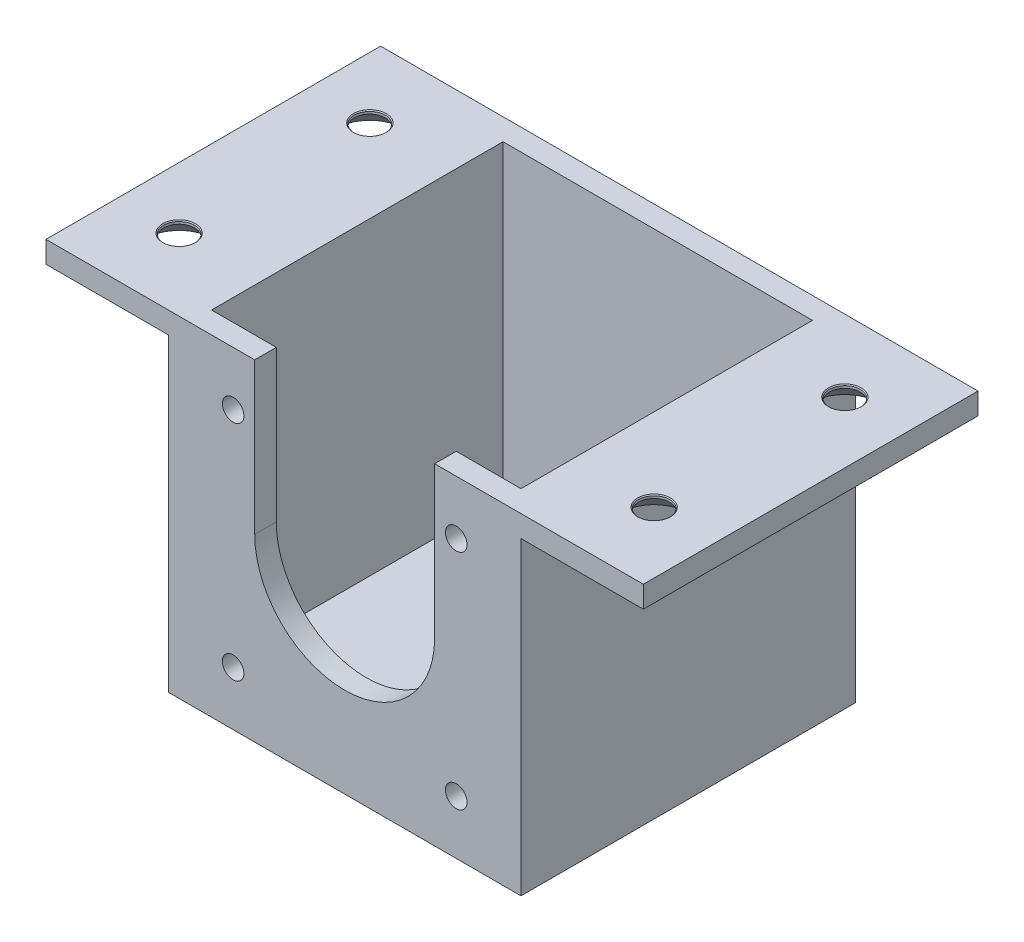
ISO-10303-21;
HEADER;
FILE_DESCRIPTION(('STEP AP214'),'2;1');
FILE_NAME('part.step','',(''),(''),'','','');
FILE_SCHEMA(('AUTOMOTIVE_DESIGN { 1 0 10303 214 1 1 1 1 }'));
ENDSEC;
DATA;
#1=APPLICATION_CONTEXT('core data for automotive mechanical design processes');
#2=APPLICATION_PROTOCOL_DEFINITION('international standard','automotive_design',2000,#1);
#3=PRODUCT_CONTEXT('',#1,'mechanical');
#4=PRODUCT('Part','Part','',(#3));
#5=PRODUCT_RELATED_PRODUCT_CATEGORY('part','',(#4));
#6=PRODUCT_DEFINITION_FORMATION('','',#4);
#7=PRODUCT_DEFINITION_CONTEXT('part definition',#1,'design');
#8=PRODUCT_DEFINITION('design','',#6,#7);
#9=PRODUCT_DEFINITION_SHAPE('','',#8);
#10=(LENGTH_UNIT() NAMED_UNIT(*) SI_UNIT(.MILLI.,.METRE.));
#11=(NAMED_UNIT(*) PLANE_ANGLE_UNIT() SI_UNIT($,.RADIAN.));
#12=(NAMED_UNIT(*) SI_UNIT($,.STERADIAN.) SOLID_ANGLE_UNIT());
#13=UNCERTAINTY_MEASURE_WITH_UNIT(LENGTH_MEASURE(1.E-05),#10,'distance_accuracy_value','');
#14=(GEOMETRIC_REPRESENTATION_CONTEXT(3) GLOBAL_UNCERTAINTY_ASSIGNED_CONTEXT((#13)) GLOBAL_UNIT_ASSIGNED_CONTEXT((#10,
#11,#12)) REPRESENTATION_CONTEXT('',''));
#15=CARTESIAN_POINT('',(0.,0.,0.));
#16=DIRECTION('',(0.,0.,1.));
#17=DIRECTION('',(1.,0.,0.));
#18=AXIS2_PLACEMENT_3D('',#15,#16,#17);
#19=CARTESIAN_POINT('',(-43.,40.,46.5));
#20=DIRECTION('',(0.,1.,0.));
#21=DIRECTION('',(0.,0.,1.));
#22=AXIS2_PLACEMENT_3D('',#19,#20,#21);
#23=PLANE('',#22);
#24=CARTESIAN_POINT('',(-54.5,40.,10.));
#25=DIRECTION('',(0.,-1.,0.));
#26=DIRECTION('',(0.,0.,-1.));
#27=AXIS2_PLACEMENT_3D('',#24,#25,#26);
#28=CIRCLE('',#27,4.7);
#29=CARTESIAN_POINT('',(-54.5,40.,5.3));
#30=VERTEX_POINT('',#29);
#31=EDGE_CURVE('E240',#30,#30,#28,.T.);
#32=ORIENTED_EDGE('',*,*,#31,.F.);
#33=EDGE_LOOP('',(#32));
#34=FACE_BOUND('',#33,.T.);
#35=DIRECTION('',(1.,0.,0.));
#36=VECTOR('',#35,1.);
#37=CARTESIAN_POINT('',(-43.,40.,0.));
#38=LINE('',#37,#36);
#39=CARTESIAN_POINT('',(-63.,40.,0.));
#40=VERTEX_POINT('',#39);
#41=CARTESIAN_POINT('',(-46.,40.,0.));
#42=VERTEX_POINT('',#41);
#43=EDGE_CURVE('E367',#40,#42,#38,.T.);
#44=ORIENTED_EDGE('',*,*,#43,.T.);
#45=DIRECTION('',(0.,0.,-1.));
#46=VECTOR('',#45,1.);
#47=CARTESIAN_POINT('',(-46.,40.,46.5));
#48=LINE('',#47,#46);
#49=CARTESIAN_POINT('',(-46.,40.,46.5));
#50=VERTEX_POINT('',#49);
#51=EDGE_CURVE('E383',#50,#42,#48,.T.);
#52=ORIENTED_EDGE('',*,*,#51,.F.);
#53=DIRECTION('',(1.,0.,0.));
#54=VECTOR('',#53,1.);
#55=CARTESIAN_POINT('',(-43.,40.,46.5));
#56=LINE('',#55,#54);
#57=CARTESIAN_POINT('',(-63.,40.,46.5));
#58=VERTEX_POINT('',#57);
#59=EDGE_CURVE('E348',#58,#50,#56,.T.);
#60=ORIENTED_EDGE('',*,*,#59,.F.);
#61=DIRECTION('',(0.,0.,-1.));
#62=VECTOR('',#61,1.);
#63=CARTESIAN_POINT('',(-63.,40.,46.5));
#64=LINE('',#63,#62);
#65=EDGE_CURVE('E386',#58,#40,#64,.T.);
#66=ORIENTED_EDGE('',*,*,#65,.T.);
#67=EDGE_LOOP('',(#44,#52,#60,#66));
#68=FACE_BOUND('',#67,.T.);
#69=CARTESIAN_POINT('',(-54.5,40.,36.5));
#70=DIRECTION('',(0.,-1.,0.));
#71=DIRECTION('',(0.,0.,-1.));
#72=AXIS2_PLACEMENT_3D('',#69,#70,#71);
#73=CIRCLE('',#72,4.7);
#74=CARTESIAN_POINT('',(-54.5,40.,31.8));
#75=VERTEX_POINT('',#74);
#76=EDGE_CURVE('E252',#75,#75,#73,.T.);
#77=ORIENTED_EDGE('',*,*,#76,.F.);
#78=EDGE_LOOP('',(#77));
#79=FACE_BOUND('',#78,.T.);
#80=ADVANCED_FACE('F32',(#34,#68,#79),#23,.F.);
#81=CARTESIAN_POINT('',(0.,0.,46.5));
#82=DIRECTION('',(-1.,0.,0.));
#83=DIRECTION('',(0.,0.,1.));
#84=AXIS2_PLACEMENT_3D('',#81,#82,#83);
#85=PLANE('',#84);
#86=DIRECTION('',(0.,0.,-1.));
#87=VECTOR('',#86,1.);
#88=CARTESIAN_POINT('',(0.,0.,46.5));
#89=LINE('',#88,#87);
#90=CARTESIAN_POINT('',(0.,0.,43.5));
#91=VERTEX_POINT('',#90);
#92=CARTESIAN_POINT('',(0.,0.,3.));
#93=VERTEX_POINT('',#92);
#94=EDGE_CURVE('E394',#91,#93,#89,.T.);
#95=ORIENTED_EDGE('',*,*,#94,.F.);
#96=DIRECTION('',(0.,-1.,0.));
#97=VECTOR('',#96,1.);
#98=CARTESIAN_POINT('',(0.,43.,43.5));
#99=LINE('',#98,#97);
#100=CARTESIAN_POINT('',(0.,43.,43.5));
#101=VERTEX_POINT('',#100);
#102=EDGE_CURVE('E313',#101,#91,#99,.T.);
#103=ORIENTED_EDGE('',*,*,#102,.F.);
#104=DIRECTION('',(0.,0.,-1.));
#105=VECTOR('',#104,1.);
#106=CARTESIAN_POINT('',(0.,43.,46.5));
#107=LINE('',#106,#105);
#108=CARTESIAN_POINT('',(0.,43.,3.));
#109=VERTEX_POINT('',#108);
#110=EDGE_CURVE('E397',#101,#109,#107,.T.);
#111=ORIENTED_EDGE('',*,*,#110,.T.);
#112=DIRECTION('',(0.,-1.,0.));
#113=VECTOR('',#112,1.);
#114=CARTESIAN_POINT('',(0.,43.,3.));
#115=LINE('',#114,#113);
#116=EDGE_CURVE('E325',#109,#93,#115,.T.);
#117=ORIENTED_EDGE('',*,*,#116,.T.);
#118=EDGE_LOOP('',(#95,#103,#111,#117));
#119=FACE_BOUND('',#118,.T.);
#120=ADVANCED_FACE('F468',(#119),#85,.T.);
#121=CARTESIAN_POINT('',(0.,0.,46.5));
#122=DIRECTION('',(0.,1.,0.));
#123=DIRECTION('',(-1.,0.,0.));
#124=AXIS2_PLACEMENT_3D('',#121,#122,#123);
#125=PLANE('',#124);
#126=DIRECTION('',(0.,0.,-1.));
#127=VECTOR('',#126,1.);
#128=CARTESIAN_POINT('',(-8.99999999999999,0.,46.5));
#129=LINE('',#128,#127);
#130=CARTESIAN_POINT('',(-8.99999999999999,0.,15.));
#131=VERTEX_POINT('',#130);
#132=CARTESIAN_POINT('',(-9.,0.,3.));
#133=VERTEX_POINT('',#132);
#134=EDGE_CURVE('E201',#131,#133,#129,.T.);
#135=ORIENTED_EDGE('',*,*,#134,.F.);
#136=DIRECTION('',(1.,0.,0.));
#137=VECTOR('',#136,1.);
#138=CARTESIAN_POINT('',(0.,0.,15.));
#139=LINE('',#138,#137);
#140=CARTESIAN_POINT('',(-34.,0.,15.));
#141=VERTEX_POINT('',#140);
#142=EDGE_CURVE('E211',#141,#131,#139,.T.);
#143=ORIENTED_EDGE('',*,*,#142,.F.);
#144=DIRECTION('',(0.,0.,1.));
#145=VECTOR('',#144,1.);
#146=CARTESIAN_POINT('',(-34.,0.,46.5));
#147=LINE('',#146,#145);
#148=CARTESIAN_POINT('',(-34.,0.,3.));
#149=VERTEX_POINT('',#148);
#150=EDGE_CURVE('E199',#149,#141,#147,.T.);
#151=ORIENTED_EDGE('',*,*,#150,.F.);
#152=DIRECTION('',(1.,0.,0.));
#153=VECTOR('',#152,1.);
#154=CARTESIAN_POINT('',(-43.,0.,3.));
#155=LINE('',#154,#153);
#156=CARTESIAN_POINT('',(-43.,0.,3.));
#157=VERTEX_POINT('',#156);
#158=EDGE_CURVE('E326',#157,#149,#155,.T.);
#159=ORIENTED_EDGE('',*,*,#158,.F.);
#160=DIRECTION('',(0.,0.,-1.));
#161=VECTOR('',#160,1.);
#162=CARTESIAN_POINT('',(-43.,0.,46.5));
#163=LINE('',#162,#161);
#164=CARTESIAN_POINT('',(-43.,0.,43.5));
#165=VERTEX_POINT('',#164);
#166=EDGE_CURVE('E392',#165,#157,#163,.T.);
#167=ORIENTED_EDGE('',*,*,#166,.F.);
#168=DIRECTION('',(-1.,0.,0.));
#169=VECTOR('',#168,1.);
#170=CARTESIAN_POINT('',(-43.,0.,43.5));
#171=LINE('',#170,#169);
#172=EDGE_CURVE('E309',#91,#165,#171,.T.);
#173=ORIENTED_EDGE('',*,*,#172,.F.);
#174=ORIENTED_EDGE('',*,*,#94,.T.);
#175=EDGE_CURVE('E321',#133,#93,#155,.T.);
#176=ORIENTED_EDGE('',*,*,#175,.F.);
#177=EDGE_LOOP('',(#135,#143,#151,#159,#167,#173,#174,#176));
#178=FACE_BOUND('',#177,.T.);
#179=ADVANCED_FACE('F415',(#178),#125,.T.);
#180=CARTESIAN_POINT('',(-43.,0.,46.5));
#181=DIRECTION('',(1.,0.,0.));
#182=DIRECTION('',(0.,0.,-1.));
#183=AXIS2_PLACEMENT_3D('',#180,#181,#182);
#184=PLANE('',#183);
#185=DIRECTION('',(0.,0.,-1.));
#186=VECTOR('',#185,1.);
#187=CARTESIAN_POINT('',(-43.,43.,46.5));
#188=LINE('',#187,#186);
#189=CARTESIAN_POINT('',(-43.,43.,43.5));
#190=VERTEX_POINT('',#189);
#191=CARTESIAN_POINT('',(-43.,43.,3.));
#192=VERTEX_POINT('',#191);
#193=EDGE_CURVE('E390',#190,#192,#188,.T.);
#194=ORIENTED_EDGE('',*,*,#193,.F.);
#195=DIRECTION('',(0.,-1.,0.));
#196=VECTOR('',#195,1.);
#197=CARTESIAN_POINT('',(-43.,43.,43.5));
#198=LINE('',#197,#196);
#199=EDGE_CURVE('E319',#190,#165,#198,.T.);
#200=ORIENTED_EDGE('',*,*,#199,.T.);
#201=ORIENTED_EDGE('',*,*,#166,.T.);
#202=DIRECTION('',(0.,-1.,0.));
#203=VECTOR('',#202,1.);
#204=CARTESIAN_POINT('',(-43.,43.,3.));
#205=LINE('',#204,#203);
#206=EDGE_CURVE('E331',#192,#157,#205,.T.);
#207=ORIENTED_EDGE('',*,*,#206,.F.);
#208=EDGE_LOOP('',(#194,#200,#201,#207));
#209=FACE_BOUND('',#208,.T.);
#210=ADVANCED_FACE('F545',(#209),#184,.T.);
#211=CARTESIAN_POINT('',(0.,40.,46.5));
#212=DIRECTION('',(0.,1.,0.));
#213=DIRECTION('',(-1.,0.,0.));
#214=AXIS2_PLACEMENT_3D('',#211,#212,#213);
#215=PLANE('',#214);
#216=CARTESIAN_POINT('',(11.5,40.,10.));
#217=DIRECTION('',(0.,-1.,0.));
#218=DIRECTION('',(0.,0.,-1.));
#219=AXIS2_PLACEMENT_3D('',#216,#217,#218);
#220=CIRCLE('',#219,4.7);
#221=CARTESIAN_POINT('',(11.5,40.,5.3));
#222=VERTEX_POINT('',#221);
#223=EDGE_CURVE('E216',#222,#222,#220,.T.);
#224=ORIENTED_EDGE('',*,*,#223,.F.);
#225=EDGE_LOOP('',(#224));
#226=FACE_BOUND('',#225,.T.);
#227=CARTESIAN_POINT('',(11.5,40.,36.5));
#228=DIRECTION('',(0.,-1.,0.));
#229=DIRECTION('',(0.,0.,-1.));
#230=AXIS2_PLACEMENT_3D('',#227,#228,#229);
#231=CIRCLE('',#230,4.7);
#232=CARTESIAN_POINT('',(11.5,40.,31.8));
#233=VERTEX_POINT('',#232);
#234=EDGE_CURVE('E228',#233,#233,#231,.T.);
#235=ORIENTED_EDGE('',*,*,#234,.F.);
#236=EDGE_LOOP('',(#235));
#237=FACE_BOUND('',#236,.T.);
#238=DIRECTION('',(1.,0.,0.));
#239=VECTOR('',#238,1.);
#240=CARTESIAN_POINT('',(0.,40.,0.));
#241=LINE('',#240,#239);
#242=CARTESIAN_POINT('',(3.,40.,0.));
#243=VERTEX_POINT('',#242);
#244=CARTESIAN_POINT('',(20.,40.,0.));
#245=VERTEX_POINT('',#244);
#246=EDGE_CURVE('E334',#243,#245,#241,.T.);
#247=ORIENTED_EDGE('',*,*,#246,.T.);
#248=DIRECTION('',(0.,0.,-1.));
#249=VECTOR('',#248,1.);
#250=CARTESIAN_POINT('',(20.,40.,46.5));
#251=LINE('',#250,#249);
#252=CARTESIAN_POINT('',(20.,40.,46.5));
#253=VERTEX_POINT('',#252);
#254=EDGE_CURVE('E402',#253,#245,#251,.T.);
#255=ORIENTED_EDGE('',*,*,#254,.F.);
#256=DIRECTION('',(1.,0.,0.));
#257=VECTOR('',#256,1.);
#258=CARTESIAN_POINT('',(0.,40.,46.5));
#259=LINE('',#258,#257);
#260=CARTESIAN_POINT('',(3.,40.,46.5));
#261=VERTEX_POINT('',#260);
#262=EDGE_CURVE('E335',#261,#253,#259,.T.);
#263=ORIENTED_EDGE('',*,*,#262,.F.);
#264=DIRECTION('',(0.,0.,-1.));
#265=VECTOR('',#264,1.);
#266=CARTESIAN_POINT('',(3.,40.,46.5));
#267=LINE('',#266,#265);
#268=EDGE_CURVE('E356',#261,#243,#267,.T.);
#269=ORIENTED_EDGE('',*,*,#268,.T.);
#270=EDGE_LOOP('',(#247,#255,#263,#269));
#271=FACE_BOUND('',#270,.T.);
#272=ADVANCED_FACE('F34',(#226,#237,#271),#215,.F.);
#273=CARTESIAN_POINT('',(20.,43.,46.5));
#274=DIRECTION('',(1.,0.,0.));
#275=DIRECTION('',(0.,0.,-1.));
#276=AXIS2_PLACEMENT_3D('',#273,#274,#275);
#277=PLANE('',#276);
#278=DIRECTION('',(0.,-1.,0.));
#279=VECTOR('',#278,1.);
#280=CARTESIAN_POINT('',(20.,43.,0.));
#281=LINE('',#280,#279);
#282=CARTESIAN_POINT('',(20.,43.,0.));
#283=VERTEX_POINT('',#282);
#284=EDGE_CURVE('E359',#283,#245,#281,.T.);
#285=ORIENTED_EDGE('',*,*,#284,.F.);
#286=DIRECTION('',(0.,0.,-1.));
#287=VECTOR('',#286,1.);
#288=CARTESIAN_POINT('',(20.,43.,46.5));
#289=LINE('',#288,#287);
#290=CARTESIAN_POINT('',(20.,43.,46.5));
#291=VERTEX_POINT('',#290);
#292=EDGE_CURVE('E399',#291,#283,#289,.T.);
#293=ORIENTED_EDGE('',*,*,#292,.F.);
#294=DIRECTION('',(0.,-1.,0.));
#295=VECTOR('',#294,1.);
#296=CARTESIAN_POINT('',(20.,43.,46.5));
#297=LINE('',#296,#295);
#298=EDGE_CURVE('E337',#291,#253,#297,.T.);
#299=ORIENTED_EDGE('',*,*,#298,.T.);
#300=ORIENTED_EDGE('',*,*,#254,.T.);
#301=EDGE_LOOP('',(#285,#293,#299,#300));
#302=FACE_BOUND('',#301,.T.);
#303=ADVANCED_FACE('F454',(#302),#277,.T.);
#304=CARTESIAN_POINT('',(-43.,43.,46.5));
#305=DIRECTION('',(0.,1.,0.));
#306=DIRECTION('',(0.,0.,1.));
#307=AXIS2_PLACEMENT_3D('',#304,#305,#306);
#308=PLANE('',#307);
#309=CARTESIAN_POINT('',(11.5,43.,10.));
#310=DIRECTION('',(0.,-1.,0.));
#311=DIRECTION('',(0.,0.,-1.));
#312=AXIS2_PLACEMENT_3D('',#309,#310,#311);
#313=CIRCLE('',#312,2.275);
#314=CARTESIAN_POINT('',(11.5,43.,7.725));
#315=VERTEX_POINT('',#314);
#316=EDGE_CURVE('E213',#315,#315,#313,.T.);
#317=ORIENTED_EDGE('',*,*,#316,.T.);
#318=EDGE_LOOP('',(#317));
#319=FACE_BOUND('',#318,.T.);
#320=CARTESIAN_POINT('',(11.5,43.,36.5));
#321=DIRECTION('',(0.,-1.,0.));
#322=DIRECTION('',(0.,0.,-1.));
#323=AXIS2_PLACEMENT_3D('',#320,#321,#322);
#324=CIRCLE('',#323,2.275);
#325=CARTESIAN_POINT('',(11.5,43.,34.225));
#326=VERTEX_POINT('',#325);
#327=EDGE_CURVE('E225',#326,#326,#324,.T.);
#328=ORIENTED_EDGE('',*,*,#327,.T.);
#329=EDGE_LOOP('',(#328));
#330=FACE_BOUND('',#329,.T.);
#331=CARTESIAN_POINT('',(-54.5,43.,10.));
#332=DIRECTION('',(0.,-1.,0.));
#333=DIRECTION('',(0.,0.,-1.));
#334=AXIS2_PLACEMENT_3D('',#331,#332,#333);
#335=CIRCLE('',#334,2.275);
#336=CARTESIAN_POINT('',(-54.5,43.,7.725));
#337=VERTEX_POINT('',#336);
#338=EDGE_CURVE('E237',#337,#337,#335,.T.);
#339=ORIENTED_EDGE('',*,*,#338,.T.);
#340=EDGE_LOOP('',(#339));
#341=FACE_BOUND('',#340,.T.);
#342=CARTESIAN_POINT('',(-54.5,43.,36.5));
#343=DIRECTION('',(0.,-1.,0.));
#344=DIRECTION('',(0.,0.,-1.));
#345=AXIS2_PLACEMENT_3D('',#342,#343,#344);
#346=CIRCLE('',#345,2.275);
#347=CARTESIAN_POINT('',(-54.5,43.,34.225));
#348=VERTEX_POINT('',#347);
#349=EDGE_CURVE('E249',#348,#348,#346,.T.);
#350=ORIENTED_EDGE('',*,*,#349,.T.);
#351=EDGE_LOOP('',(#350));
#352=FACE_BOUND('',#351,.T.);
#353=DIRECTION('',(0.,0.,1.));
#354=VECTOR('',#353,1.);
#355=CARTESIAN_POINT('',(-9.,43.,-0.001000000000001));
#356=LINE('',#355,#354);
#357=CARTESIAN_POINT('',(-9.,43.,43.5));
#358=VERTEX_POINT('',#357);
#359=CARTESIAN_POINT('',(-9.,43.,46.5));
#360=VERTEX_POINT('',#359);
#361=EDGE_CURVE('E304',#358,#360,#356,.T.);
#362=ORIENTED_EDGE('',*,*,#361,.T.);
#363=DIRECTION('',(1.,0.,0.));
#364=VECTOR('',#363,1.);
#365=CARTESIAN_POINT('',(0.,43.,46.5));
#366=LINE('',#365,#364);
#367=EDGE_CURVE('E341',#360,#291,#366,.T.);
#368=ORIENTED_EDGE('',*,*,#367,.T.);
#369=ORIENTED_EDGE('',*,*,#292,.T.);
#370=DIRECTION('',(1.,0.,0.));
#371=VECTOR('',#370,1.);
#372=CARTESIAN_POINT('',(-43.,43.,0.));
#373=LINE('',#372,#371);
#374=CARTESIAN_POINT('',(-63.,43.,0.));
#375=VERTEX_POINT('',#374);
#376=EDGE_CURVE('E362',#375,#283,#373,.T.);
#377=ORIENTED_EDGE('',*,*,#376,.F.);
#378=DIRECTION('',(0.,0.,-1.));
#379=VECTOR('',#378,1.);
#380=CARTESIAN_POINT('',(-63.,43.,46.5));
#381=LINE('',#380,#379);
#382=CARTESIAN_POINT('',(-63.,43.,46.5));
#383=VERTEX_POINT('',#382);
#384=EDGE_CURVE('E388',#383,#375,#381,.T.);
#385=ORIENTED_EDGE('',*,*,#384,.F.);
#386=CARTESIAN_POINT('',(-34.,43.,46.5));
#387=VERTEX_POINT('',#386);
#388=EDGE_CURVE('E342',#383,#387,#366,.T.);
#389=ORIENTED_EDGE('',*,*,#388,.T.);
#390=DIRECTION('',(0.,0.,1.));
#391=VECTOR('',#390,1.);
#392=CARTESIAN_POINT('',(-34.,43.,-0.001000000000001));
#393=LINE('',#392,#391);
#394=CARTESIAN_POINT('',(-34.,43.,43.5));
#395=VERTEX_POINT('',#394);
#396=EDGE_CURVE('E301',#395,#387,#393,.T.);
#397=ORIENTED_EDGE('',*,*,#396,.F.);
#398=DIRECTION('',(-1.,0.,0.));
#399=VECTOR('',#398,1.);
#400=CARTESIAN_POINT('',(-43.,43.,43.5));
#401=LINE('',#400,#399);
#402=EDGE_CURVE('E314',#395,#190,#401,.T.);
#403=ORIENTED_EDGE('',*,*,#402,.T.);
#404=ORIENTED_EDGE('',*,*,#193,.T.);
#405=DIRECTION('',(1.,0.,0.));
#406=VECTOR('',#405,1.);
#407=CARTESIAN_POINT('',(-43.,43.,3.));
#408=LINE('',#407,#406);
#409=EDGE_CURVE('E322',#192,#109,#408,.T.);
#410=ORIENTED_EDGE('',*,*,#409,.T.);
#411=ORIENTED_EDGE('',*,*,#110,.F.);
#412=EDGE_CURVE('E310',#101,#358,#401,.T.);
#413=ORIENTED_EDGE('',*,*,#412,.T.);
#414=EDGE_LOOP('',(#362,#368,#369,#377,#385,#389,#397,#403,#404,#410,#411,#413));
#415=FACE_BOUND('',#414,.T.);
#416=ADVANCED_FACE('F449',(#319,#330,#341,#352,#415),#308,.T.);
#417=CARTESIAN_POINT('',(-63.,40.,46.5));
#418=DIRECTION('',(-1.,0.,0.));
#419=DIRECTION('',(0.,0.,1.));
#420=AXIS2_PLACEMENT_3D('',#417,#418,#419);
#421=PLANE('',#420);
#422=DIRECTION('',(0.,1.,0.));
#423=VECTOR('',#422,1.);
#424=CARTESIAN_POINT('',(-63.,40.,0.));
#425=LINE('',#424,#423);
#426=EDGE_CURVE('E364',#40,#375,#425,.T.);
#427=ORIENTED_EDGE('',*,*,#426,.F.);
#428=ORIENTED_EDGE('',*,*,#65,.F.);
#429=DIRECTION('',(0.,1.,0.));
#430=VECTOR('',#429,1.);
#431=CARTESIAN_POINT('',(-63.,40.,46.5));
#432=LINE('',#431,#430);
#433=EDGE_CURVE('E345',#58,#383,#432,.T.);
#434=ORIENTED_EDGE('',*,*,#433,.T.);
#435=ORIENTED_EDGE('',*,*,#384,.T.);
#436=EDGE_LOOP('',(#427,#428,#434,#435));
#437=FACE_BOUND('',#436,.T.);
#438=ADVANCED_FACE('F443',(#437),#421,.T.);
#439=CARTESIAN_POINT('',(-46.,0.,46.5));
#440=DIRECTION('',(1.,0.,0.));
#441=DIRECTION('',(0.,0.,-1.));
#442=AXIS2_PLACEMENT_3D('',#439,#440,#441);
#443=PLANE('',#442);
#444=DIRECTION('',(0.,1.,0.));
#445=VECTOR('',#444,1.);
#446=CARTESIAN_POINT('',(-46.,0.,0.));
#447=LINE('',#446,#445);
#448=CARTESIAN_POINT('',(-46.,-3.00000000000001,0.));
#449=VERTEX_POINT('',#448);
#450=EDGE_CURVE('E369',#42,#449,#447,.F.);
#451=ORIENTED_EDGE('',*,*,#450,.T.);
#452=DIRECTION('',(0.,0.,-1.));
#453=VECTOR('',#452,1.);
#454=CARTESIAN_POINT('',(-46.,-3.00000000000001,46.5));
#455=LINE('',#454,#453);
#456=CARTESIAN_POINT('',(-46.,-3.00000000000001,46.5));
#457=VERTEX_POINT('',#456);
#458=EDGE_CURVE('E380',#457,#449,#455,.T.);
#459=ORIENTED_EDGE('',*,*,#458,.F.);
#460=DIRECTION('',(0.,1.,0.));
#461=VECTOR('',#460,1.);
#462=CARTESIAN_POINT('',(-46.,0.,46.5));
#463=LINE('',#462,#461);
#464=EDGE_CURVE('E350',#50,#457,#463,.F.);
#465=ORIENTED_EDGE('',*,*,#464,.F.);
#466=ORIENTED_EDGE('',*,*,#51,.T.);
#467=EDGE_LOOP('',(#451,#459,#465,#466));
#468=FACE_BOUND('',#467,.T.);
#469=ADVANCED_FACE('F437',(#468),#443,.F.);
#470=CARTESIAN_POINT('',(0.,-3.,46.5));
#471=DIRECTION('',(0.,1.,0.));
#472=DIRECTION('',(-1.,0.,0.));
#473=AXIS2_PLACEMENT_3D('',#470,#471,#472);
#474=PLANE('',#473);
#475=DIRECTION('',(-1.,0.,0.));
#476=VECTOR('',#475,1.);
#477=CARTESIAN_POINT('',(-8.99999999999999,-3.,15.));
#478=LINE('',#477,#476);
#479=CARTESIAN_POINT('',(-8.99999999999999,-3.,15.));
#480=VERTEX_POINT('',#479);
#481=CARTESIAN_POINT('',(-34.,-3.,15.));
#482=VERTEX_POINT('',#481);
#483=EDGE_CURVE('E425',#480,#482,#478,.T.);
#484=ORIENTED_EDGE('',*,*,#483,.F.);
#485=DIRECTION('',(0.,0.,1.));
#486=VECTOR('',#485,1.);
#487=CARTESIAN_POINT('',(-8.99999999999999,-3.,0.));
#488=LINE('',#487,#486);
#489=CARTESIAN_POINT('',(-8.99999999999999,-3.,0.));
#490=VERTEX_POINT('',#489);
#491=EDGE_CURVE('E422',#490,#480,#488,.T.);
#492=ORIENTED_EDGE('',*,*,#491,.F.);
#493=DIRECTION('',(1.,0.,0.));
#494=VECTOR('',#493,1.);
#495=CARTESIAN_POINT('',(0.,-3.,0.));
#496=LINE('',#495,#494);
#497=CARTESIAN_POINT('',(3.,-3.,0.));
#498=VERTEX_POINT('',#497);
#499=EDGE_CURVE('E198',#490,#498,#496,.T.);
#500=ORIENTED_EDGE('',*,*,#499,.T.);
#501=DIRECTION('',(0.,0.,-1.));
#502=VECTOR('',#501,1.);
#503=CARTESIAN_POINT('',(3.,-3.,46.5));
#504=LINE('',#503,#502);
#505=CARTESIAN_POINT('',(3.,-3.,46.5));
#506=VERTEX_POINT('',#505);
#507=EDGE_CURVE('E377',#506,#498,#504,.T.);
#508=ORIENTED_EDGE('',*,*,#507,.F.);
#509=DIRECTION('',(1.,0.,0.));
#510=VECTOR('',#509,1.);
#511=CARTESIAN_POINT('',(0.,-3.,46.5));
#512=LINE('',#511,#510);
#513=EDGE_CURVE('E352',#457,#506,#512,.T.);
#514=ORIENTED_EDGE('',*,*,#513,.F.);
#515=ORIENTED_EDGE('',*,*,#458,.T.);
#516=CARTESIAN_POINT('',(-34.,-3.,0.));
#517=VERTEX_POINT('',#516);
#518=EDGE_CURVE('E371',#449,#517,#496,.T.);
#519=ORIENTED_EDGE('',*,*,#518,.T.);
#520=DIRECTION('',(0.,0.,-1.));
#521=VECTOR('',#520,1.);
#522=CARTESIAN_POINT('',(-34.,-3.,0.));
#523=LINE('',#522,#521);
#524=EDGE_CURVE('E187',#482,#517,#523,.T.);
#525=ORIENTED_EDGE('',*,*,#524,.F.);
#526=EDGE_LOOP('',(#484,#492,#500,#508,#514,#515,#519,#525));
#527=FACE_BOUND('',#526,.T.);
#528=ADVANCED_FACE('F428',(#527),#474,.F.);
#529=CARTESIAN_POINT('',(3.,0.,46.5));
#530=DIRECTION('',(-1.,0.,0.));
#531=DIRECTION('',(0.,0.,1.));
#532=AXIS2_PLACEMENT_3D('',#529,#530,#531);
#533=PLANE('',#532);
#534=DIRECTION('',(0.,1.,0.));
#535=VECTOR('',#534,1.);
#536=CARTESIAN_POINT('',(3.,0.,0.));
#537=LINE('',#536,#535);
#538=EDGE_CURVE('E338',#498,#243,#537,.T.);
#539=ORIENTED_EDGE('',*,*,#538,.T.);
#540=ORIENTED_EDGE('',*,*,#268,.F.);
#541=DIRECTION('',(0.,1.,0.));
#542=VECTOR('',#541,1.);
#543=CARTESIAN_POINT('',(3.,0.,46.5));
#544=LINE('',#543,#542);
#545=EDGE_CURVE('E354',#506,#261,#544,.T.);
#546=ORIENTED_EDGE('',*,*,#545,.F.);
#547=ORIENTED_EDGE('',*,*,#507,.T.);
#548=EDGE_LOOP('',(#539,#540,#546,#547));
#549=FACE_BOUND('',#548,.T.);
#550=ADVANCED_FACE('F462',(#549),#533,.F.);
#551=CARTESIAN_POINT('',(0.,0.,46.5));
#552=DIRECTION('',(0.,0.,-1.));
#553=DIRECTION('',(-1.,0.,0.));
#554=AXIS2_PLACEMENT_3D('',#551,#552,#553);
#555=PLANE('',#554);
#556=CARTESIAN_POINT('',(-6.,4.5,46.5));
#557=DIRECTION('',(0.,0.,1.));
#558=DIRECTION('',(1.,0.,0.));
#559=AXIS2_PLACEMENT_3D('',#556,#557,#558);
#560=CIRCLE('',#559,1.5);
#561=CARTESIAN_POINT('',(-4.5,4.5,46.5));
#562=VERTEX_POINT('',#561);
#563=EDGE_CURVE('E279',#562,#562,#560,.T.);
#564=ORIENTED_EDGE('',*,*,#563,.F.);
#565=EDGE_LOOP('',(#564));
#566=FACE_BOUND('',#565,.T.);
#567=CARTESIAN_POINT('',(-6.,35.5,46.5));
#568=DIRECTION('',(0.,0.,1.));
#569=DIRECTION('',(1.,0.,0.));
#570=AXIS2_PLACEMENT_3D('',#567,#568,#569);
#571=CIRCLE('',#570,1.5);
#572=CARTESIAN_POINT('',(-4.5,35.5,46.5));
#573=VERTEX_POINT('',#572);
#574=EDGE_CURVE('E273',#573,#573,#571,.T.);
#575=ORIENTED_EDGE('',*,*,#574,.F.);
#576=EDGE_LOOP('',(#575));
#577=FACE_BOUND('',#576,.T.);
#578=CARTESIAN_POINT('',(-37.,35.5,46.5));
#579=DIRECTION('',(0.,0.,1.));
#580=DIRECTION('',(1.,0.,0.));
#581=AXIS2_PLACEMENT_3D('',#578,#579,#580);
#582=CIRCLE('',#581,1.5);
#583=CARTESIAN_POINT('',(-35.5,35.5,46.5));
#584=VERTEX_POINT('',#583);
#585=EDGE_CURVE('E266',#584,#584,#582,.T.);
#586=ORIENTED_EDGE('',*,*,#585,.F.);
#587=EDGE_LOOP('',(#586));
#588=FACE_BOUND('',#587,.T.);
#589=CARTESIAN_POINT('',(-37.,4.49999999999999,46.5));
#590=DIRECTION('',(0.,0.,1.));
#591=DIRECTION('',(1.,0.,0.));
#592=AXIS2_PLACEMENT_3D('',#589,#590,#591);
#593=CIRCLE('',#592,1.5);
#594=CARTESIAN_POINT('',(-35.5,4.49999999999999,46.5));
#595=VERTEX_POINT('',#594);
#596=EDGE_CURVE('E265',#595,#595,#593,.T.);
#597=ORIENTED_EDGE('',*,*,#596,.F.);
#598=EDGE_LOOP('',(#597));
#599=FACE_BOUND('',#598,.T.);
#600=ORIENTED_EDGE('',*,*,#367,.F.);
#601=DIRECTION('',(0.,1.,0.));
#602=VECTOR('',#601,1.);
#603=CARTESIAN_POINT('',(-9.,43.,46.5));
#604=LINE('',#603,#602);
#605=CARTESIAN_POINT('',(-9.,22.,46.5));
#606=VERTEX_POINT('',#605);
#607=EDGE_CURVE('E288',#606,#360,#604,.T.);
#608=ORIENTED_EDGE('',*,*,#607,.F.);
#609=CARTESIAN_POINT('',(-21.5,22.,46.5));
#610=DIRECTION('',(0.,0.,1.));
#611=DIRECTION('',(-1.,0.,0.));
#612=AXIS2_PLACEMENT_3D('',#609,#610,#611);
#613=CIRCLE('',#612,12.5);
#614=CARTESIAN_POINT('',(-34.,22.,46.5));
#615=VERTEX_POINT('',#614);
#616=EDGE_CURVE('E291',#615,#606,#613,.T.);
#617=ORIENTED_EDGE('',*,*,#616,.F.);
#618=DIRECTION('',(0.,-1.,0.));
#619=VECTOR('',#618,1.);
#620=CARTESIAN_POINT('',(-34.,43.,46.5));
#621=LINE('',#620,#619);
#622=EDGE_CURVE('E294',#387,#615,#621,.T.);
#623=ORIENTED_EDGE('',*,*,#622,.F.);
#624=ORIENTED_EDGE('',*,*,#388,.F.);
#625=ORIENTED_EDGE('',*,*,#433,.F.);
#626=ORIENTED_EDGE('',*,*,#59,.T.);
#627=ORIENTED_EDGE('',*,*,#464,.T.);
#628=ORIENTED_EDGE('',*,*,#513,.T.);
#629=ORIENTED_EDGE('',*,*,#545,.T.);
#630=ORIENTED_EDGE('',*,*,#262,.T.);
#631=ORIENTED_EDGE('',*,*,#298,.F.);
#632=EDGE_LOOP('',(#600,#608,#617,#623,#624,#625,#626,#627,#628,#629,#630,#631));
#633=FACE_BOUND('',#632,.T.);
#634=ADVANCED_FACE('F465',(#566,#577,#588,#599,#633),#555,.F.);
#635=CARTESIAN_POINT('',(0.,0.,0.));
#636=DIRECTION('',(0.,0.,-1.));
#637=DIRECTION('',(-1.,0.,0.));
#638=AXIS2_PLACEMENT_3D('',#635,#636,#637);
#639=PLANE('',#638);
#640=DIRECTION('',(0.,-1.,0.));
#641=VECTOR('',#640,1.);
#642=CARTESIAN_POINT('',(-8.99999999999999,2.,0.));
#643=LINE('',#642,#641);
#644=CARTESIAN_POINT('',(-8.99999999999999,2.,0.));
#645=VERTEX_POINT('',#644);
#646=EDGE_CURVE('E183',#645,#490,#643,.T.);
#647=ORIENTED_EDGE('',*,*,#646,.F.);
#648=DIRECTION('',(1.,0.,0.));
#649=VECTOR('',#648,1.);
#650=CARTESIAN_POINT('',(-8.99999999999999,2.,0.));
#651=LINE('',#650,#649);
#652=CARTESIAN_POINT('',(-34.,2.,0.));
#653=VERTEX_POINT('',#652);
#654=EDGE_CURVE('E190',#653,#645,#651,.T.);
#655=ORIENTED_EDGE('',*,*,#654,.F.);
#656=DIRECTION('',(0.,-1.,0.));
#657=VECTOR('',#656,1.);
#658=CARTESIAN_POINT('',(-34.,2.,0.));
#659=LINE('',#658,#657);
#660=EDGE_CURVE('E47',#653,#517,#659,.T.);
#661=ORIENTED_EDGE('',*,*,#660,.T.);
#662=ORIENTED_EDGE('',*,*,#518,.F.);
#663=ORIENTED_EDGE('',*,*,#450,.F.);
#664=ORIENTED_EDGE('',*,*,#43,.F.);
#665=ORIENTED_EDGE('',*,*,#426,.T.);
#666=ORIENTED_EDGE('',*,*,#376,.T.);
#667=ORIENTED_EDGE('',*,*,#284,.T.);
#668=ORIENTED_EDGE('',*,*,#246,.F.);
#669=ORIENTED_EDGE('',*,*,#538,.F.);
#670=ORIENTED_EDGE('',*,*,#499,.F.);
#671=EDGE_LOOP('',(#647,#655,#661,#662,#663,#664,#665,#666,#667,#668,#669,#670));
#672=FACE_BOUND('',#671,.T.);
#673=ADVANCED_FACE('F196',(#672),#639,.T.);
#674=CARTESIAN_POINT('',(-43.,43.,3.));
#675=DIRECTION('',(0.,0.,-1.));
#676=DIRECTION('',(-1.,0.,0.));
#677=AXIS2_PLACEMENT_3D('',#674,#675,#676);
#678=PLANE('',#677);
#679=DIRECTION('',(-1.,0.,0.));
#680=VECTOR('',#679,1.);
#681=CARTESIAN_POINT('',(-43.,1.99999999999999,3.));
#682=LINE('',#681,#680);
#683=CARTESIAN_POINT('',(-8.99999999999999,2.,3.));
#684=VERTEX_POINT('',#683);
#685=CARTESIAN_POINT('',(-34.,2.,3.));
#686=VERTEX_POINT('',#685);
#687=EDGE_CURVE('E404',#684,#686,#682,.T.);
#688=ORIENTED_EDGE('',*,*,#687,.F.);
#689=DIRECTION('',(0.,-1.,0.));
#690=VECTOR('',#689,1.);
#691=CARTESIAN_POINT('',(-9.,43.,3.));
#692=LINE('',#691,#690);
#693=EDGE_CURVE('E11',#684,#133,#692,.T.);
#694=ORIENTED_EDGE('',*,*,#693,.T.);
#695=ORIENTED_EDGE('',*,*,#175,.T.);
#696=ORIENTED_EDGE('',*,*,#116,.F.);
#697=ORIENTED_EDGE('',*,*,#409,.F.);
#698=ORIENTED_EDGE('',*,*,#206,.T.);
#699=ORIENTED_EDGE('',*,*,#158,.T.);
#700=DIRECTION('',(0.,1.,0.));
#701=VECTOR('',#700,1.);
#702=CARTESIAN_POINT('',(-34.,43.,3.));
#703=LINE('',#702,#701);
#704=EDGE_CURVE('E40',#149,#686,#703,.T.);
#705=ORIENTED_EDGE('',*,*,#704,.T.);
#706=EDGE_LOOP('',(#688,#694,#695,#696,#697,#698,#699,#705));
#707=FACE_BOUND('',#706,.T.);
#708=ADVANCED_FACE('F407',(#707),#678,.F.);
#709=CARTESIAN_POINT('',(-43.,43.,43.5));
#710=DIRECTION('',(0.,0.,1.));
#711=DIRECTION('',(1.,0.,0.));
#712=AXIS2_PLACEMENT_3D('',#709,#710,#711);
#713=PLANE('',#712);
#714=CARTESIAN_POINT('',(-6.,4.5,43.5));
#715=DIRECTION('',(0.,0.,1.));
#716=DIRECTION('',(1.,0.,0.));
#717=AXIS2_PLACEMENT_3D('',#714,#715,#716);
#718=CIRCLE('',#717,1.5);
#719=CARTESIAN_POINT('',(-4.5,4.5,43.5));
#720=VERTEX_POINT('',#719);
#721=EDGE_CURVE('E261',#720,#720,#718,.F.);
#722=ORIENTED_EDGE('',*,*,#721,.F.);
#723=EDGE_LOOP('',(#722));
#724=FACE_BOUND('',#723,.T.);
#725=CARTESIAN_POINT('',(-6.,35.5,43.5));
#726=DIRECTION('',(0.,0.,1.));
#727=DIRECTION('',(1.,0.,0.));
#728=AXIS2_PLACEMENT_3D('',#725,#726,#727);
#729=CIRCLE('',#728,1.5);
#730=CARTESIAN_POINT('',(-4.5,35.5,43.5));
#731=VERTEX_POINT('',#730);
#732=EDGE_CURVE('E276',#731,#731,#729,.F.);
#733=ORIENTED_EDGE('',*,*,#732,.F.);
#734=EDGE_LOOP('',(#733));
#735=FACE_BOUND('',#734,.T.);
#736=CARTESIAN_POINT('',(-37.,35.5,43.5));
#737=DIRECTION('',(0.,0.,1.));
#738=DIRECTION('',(1.,0.,0.));
#739=AXIS2_PLACEMENT_3D('',#736,#737,#738);
#740=CIRCLE('',#739,1.5);
#741=CARTESIAN_POINT('',(-35.5,35.5,43.5));
#742=VERTEX_POINT('',#741);
#743=EDGE_CURVE('E270',#742,#742,#740,.F.);
#744=ORIENTED_EDGE('',*,*,#743,.F.);
#745=EDGE_LOOP('',(#744));
#746=FACE_BOUND('',#745,.T.);
#747=CARTESIAN_POINT('',(-37.,4.49999999999999,43.5));
#748=DIRECTION('',(0.,0.,1.));
#749=DIRECTION('',(1.,0.,0.));
#750=AXIS2_PLACEMENT_3D('',#747,#748,#749);
#751=CIRCLE('',#750,1.5);
#752=CARTESIAN_POINT('',(-35.5,4.49999999999999,43.5));
#753=VERTEX_POINT('',#752);
#754=EDGE_CURVE('E262',#753,#753,#751,.F.);
#755=ORIENTED_EDGE('',*,*,#754,.F.);
#756=EDGE_LOOP('',(#755));
#757=FACE_BOUND('',#756,.T.);
#758=CARTESIAN_POINT('',(-21.5,22.,43.5));
#759=DIRECTION('',(0.,0.,1.));
#760=DIRECTION('',(1.,0.,0.));
#761=AXIS2_PLACEMENT_3D('',#758,#759,#760);
#762=CIRCLE('',#761,12.5);
#763=CARTESIAN_POINT('',(-9.,22.,43.5));
#764=VERTEX_POINT('',#763);
#765=CARTESIAN_POINT('',(-34.,22.,43.5));
#766=VERTEX_POINT('',#765);
#767=EDGE_CURVE('E269',#764,#766,#762,.F.);
#768=ORIENTED_EDGE('',*,*,#767,.F.);
#769=DIRECTION('',(0.,-1.,0.));
#770=VECTOR('',#769,1.);
#771=CARTESIAN_POINT('',(-9.,43.,43.5));
#772=LINE('',#771,#770);
#773=EDGE_CURVE('E297',#358,#764,#772,.T.);
#774=ORIENTED_EDGE('',*,*,#773,.F.);
#775=ORIENTED_EDGE('',*,*,#412,.F.);
#776=ORIENTED_EDGE('',*,*,#102,.T.);
#777=ORIENTED_EDGE('',*,*,#172,.T.);
#778=ORIENTED_EDGE('',*,*,#199,.F.);
#779=ORIENTED_EDGE('',*,*,#402,.F.);
#780=DIRECTION('',(0.,1.,0.));
#781=VECTOR('',#780,1.);
#782=CARTESIAN_POINT('',(-34.,43.,43.5));
#783=LINE('',#782,#781);
#784=EDGE_CURVE('E287',#766,#395,#783,.T.);
#785=ORIENTED_EDGE('',*,*,#784,.F.);
#786=EDGE_LOOP('',(#768,#774,#775,#776,#777,#778,#779,#785));
#787=FACE_BOUND('',#786,.T.);
#788=ADVANCED_FACE('F522',(#724,#735,#746,#757,#787),#713,.F.);
#789=CARTESIAN_POINT('',(-21.5,22.,-0.001000000000001));
#790=DIRECTION('',(0.,0.,1.));
#791=DIRECTION('',(1.,0.,0.));
#792=AXIS2_PLACEMENT_3D('',#789,#790,#791);
#793=CYLINDRICAL_SURFACE('',#792,12.5);
#794=ORIENTED_EDGE('',*,*,#767,.T.);
#795=DIRECTION('',(0.,0.,1.));
#796=VECTOR('',#795,1.);
#797=CARTESIAN_POINT('',(-34.,22.,-0.001000000000001));
#798=LINE('',#797,#796);
#799=EDGE_CURVE('E303',#766,#615,#798,.T.);
#800=ORIENTED_EDGE('',*,*,#799,.T.);
#801=ORIENTED_EDGE('',*,*,#616,.T.);
#802=DIRECTION('',(0.,0.,1.));
#803=VECTOR('',#802,1.);
#804=CARTESIAN_POINT('',(-9.,22.,-0.001000000000001));
#805=LINE('',#804,#803);
#806=EDGE_CURVE('E290',#764,#606,#805,.T.);
#807=ORIENTED_EDGE('',*,*,#806,.F.);
#808=EDGE_LOOP('',(#794,#800,#801,#807));
#809=FACE_BOUND('',#808,.T.);
#810=ADVANCED_FACE('F518',(#809),#793,.F.);
#811=CARTESIAN_POINT('',(-9.,43.,-0.001000000000001));
#812=DIRECTION('',(1.,0.,0.));
#813=DIRECTION('',(0.,0.,-1.));
#814=AXIS2_PLACEMENT_3D('',#811,#812,#813);
#815=PLANE('',#814);
#816=ORIENTED_EDGE('',*,*,#773,.T.);
#817=ORIENTED_EDGE('',*,*,#806,.T.);
#818=ORIENTED_EDGE('',*,*,#607,.T.);
#819=ORIENTED_EDGE('',*,*,#361,.F.);
#820=EDGE_LOOP('',(#816,#817,#818,#819));
#821=FACE_BOUND('',#820,.T.);
#822=ADVANCED_FACE('F514',(#821),#815,.F.);
#823=CARTESIAN_POINT('',(-34.,43.,-0.001000000000001));
#824=DIRECTION('',(-1.,0.,0.));
#825=DIRECTION('',(0.,0.,1.));
#826=AXIS2_PLACEMENT_3D('',#823,#824,#825);
#827=PLANE('',#826);
#828=ORIENTED_EDGE('',*,*,#784,.T.);
#829=ORIENTED_EDGE('',*,*,#396,.T.);
#830=ORIENTED_EDGE('',*,*,#622,.T.);
#831=ORIENTED_EDGE('',*,*,#799,.F.);
#832=EDGE_LOOP('',(#828,#829,#830,#831));
#833=FACE_BOUND('',#832,.T.);
#834=ADVANCED_FACE('F500',(#833),#827,.F.);
#835=CARTESIAN_POINT('',(-37.,4.49999999999999,-0.001000000000001));
#836=DIRECTION('',(0.,0.,1.));
#837=DIRECTION('',(1.,0.,0.));
#838=AXIS2_PLACEMENT_3D('',#835,#836,#837);
#839=CYLINDRICAL_SURFACE('',#838,1.5);
#840=ORIENTED_EDGE('',*,*,#596,.T.);
#841=EDGE_LOOP('',(#840));
#842=FACE_BOUND('',#841,.T.);
#843=ORIENTED_EDGE('',*,*,#754,.T.);
#844=EDGE_LOOP('',(#843));
#845=FACE_BOUND('',#844,.T.);
#846=ADVANCED_FACE('F496',(#842,#845),#839,.F.);
#847=CARTESIAN_POINT('',(-37.,35.5,-0.001000000000001));
#848=DIRECTION('',(0.,0.,1.));
#849=DIRECTION('',(1.,0.,0.));
#850=AXIS2_PLACEMENT_3D('',#847,#848,#849);
#851=CYLINDRICAL_SURFACE('',#850,1.5);
#852=ORIENTED_EDGE('',*,*,#585,.T.);
#853=EDGE_LOOP('',(#852));
#854=FACE_BOUND('',#853,.T.);
#855=ORIENTED_EDGE('',*,*,#743,.T.);
#856=EDGE_LOOP('',(#855));
#857=FACE_BOUND('',#856,.T.);
#858=ADVANCED_FACE('F499',(#854,#857),#851,.F.);
#859=CARTESIAN_POINT('',(-6.,35.5,-0.001000000000001));
#860=DIRECTION('',(0.,0.,1.));
#861=DIRECTION('',(1.,0.,0.));
#862=AXIS2_PLACEMENT_3D('',#859,#860,#861);
#863=CYLINDRICAL_SURFACE('',#862,1.5);
#864=ORIENTED_EDGE('',*,*,#574,.T.);
#865=EDGE_LOOP('',(#864));
#866=FACE_BOUND('',#865,.T.);
#867=ORIENTED_EDGE('',*,*,#732,.T.);
#868=EDGE_LOOP('',(#867));
#869=FACE_BOUND('',#868,.T.);
#870=ADVANCED_FACE('F504',(#866,#869),#863,.F.);
#871=CARTESIAN_POINT('',(-6.,4.5,-0.001000000000001));
#872=DIRECTION('',(0.,0.,1.));
#873=DIRECTION('',(1.,0.,0.));
#874=AXIS2_PLACEMENT_3D('',#871,#872,#873);
#875=CYLINDRICAL_SURFACE('',#874,1.5);
#876=ORIENTED_EDGE('',*,*,#563,.T.);
#877=EDGE_LOOP('',(#876));
#878=FACE_BOUND('',#877,.T.);
#879=ORIENTED_EDGE('',*,*,#721,.T.);
#880=EDGE_LOOP('',(#879));
#881=FACE_BOUND('',#880,.T.);
#882=ADVANCED_FACE('F494',(#878,#881),#875,.F.);
#883=CARTESIAN_POINT('',(-54.5,42.875,36.5));
#884=DIRECTION('',(0.,1.,0.));
#885=DIRECTION('',(0.,0.,1.));
#886=AXIS2_PLACEMENT_3D('',#883,#884,#885);
#887=CONICAL_SURFACE('',#886,2.15,0.785398163397448);
#888=ORIENTED_EDGE('',*,*,#349,.F.);
#889=EDGE_LOOP('',(#888));
#890=FACE_BOUND('',#889,.T.);
#891=CARTESIAN_POINT('',(-54.5,42.875,36.5));
#892=DIRECTION('',(0.,-1.,0.));
#893=DIRECTION('',(0.,0.,-1.));
#894=AXIS2_PLACEMENT_3D('',#891,#892,#893);
#895=CIRCLE('',#894,2.15);
#896=CARTESIAN_POINT('',(-54.5,42.875,34.35));
#897=VERTEX_POINT('',#896);
#898=EDGE_CURVE('E258',#897,#897,#895,.T.);
#899=ORIENTED_EDGE('',*,*,#898,.T.);
#900=EDGE_LOOP('',(#899));
#901=FACE_BOUND('',#900,.T.);
#902=ADVANCED_FACE('F486',(#890,#901),#887,.F.);
#903=CARTESIAN_POINT('',(-54.5,40.,36.5));
#904=DIRECTION('',(0.,-1.,0.));
#905=DIRECTION('',(0.,0.,-1.));
#906=AXIS2_PLACEMENT_3D('',#903,#904,#905);
#907=CYLINDRICAL_SURFACE('',#906,2.15);
#908=ORIENTED_EDGE('',*,*,#898,.F.);
#909=EDGE_LOOP('',(#908));
#910=FACE_BOUND('',#909,.T.);
#911=CARTESIAN_POINT('',(-54.5,42.55,36.5));
#912=DIRECTION('',(0.,-1.,0.));
#913=DIRECTION('',(0.,0.,-1.));
#914=AXIS2_PLACEMENT_3D('',#911,#912,#913);
#915=CIRCLE('',#914,2.15);
#916=CARTESIAN_POINT('',(-54.5,42.55,34.35));
#917=VERTEX_POINT('',#916);
#918=EDGE_CURVE('E255',#917,#917,#915,.T.);
#919=ORIENTED_EDGE('',*,*,#918,.T.);
#920=EDGE_LOOP('',(#919));
#921=FACE_BOUND('',#920,.T.);
#922=ADVANCED_FACE('F476',(#910,#921),#907,.F.);
#923=CARTESIAN_POINT('',(-54.5,40.,36.5));
#924=DIRECTION('',(0.,-1.,0.));
#925=DIRECTION('',(0.,0.,-1.));
#926=AXIS2_PLACEMENT_3D('',#923,#924,#925);
#927=CONICAL_SURFACE('',#926,4.7,0.785398163397448);
#928=ORIENTED_EDGE('',*,*,#918,.F.);
#929=EDGE_LOOP('',(#928));
#930=FACE_BOUND('',#929,.T.);
#931=ORIENTED_EDGE('',*,*,#76,.T.);
#932=EDGE_LOOP('',(#931));
#933=FACE_BOUND('',#932,.T.);
#934=ADVANCED_FACE('F473',(#930,#933),#927,.F.);
#935=CARTESIAN_POINT('',(-54.5,42.875,10.));
#936=DIRECTION('',(0.,1.,0.));
#937=DIRECTION('',(0.,0.,1.));
#938=AXIS2_PLACEMENT_3D('',#935,#936,#937);
#939=CONICAL_SURFACE('',#938,2.15,0.785398163397448);
#940=ORIENTED_EDGE('',*,*,#338,.F.);
#941=EDGE_LOOP('',(#940));
#942=FACE_BOUND('',#941,.T.);
#943=CARTESIAN_POINT('',(-54.5,42.875,10.));
#944=DIRECTION('',(0.,-1.,0.));
#945=DIRECTION('',(0.,0.,-1.));
#946=AXIS2_PLACEMENT_3D('',#943,#944,#945);
#947=CIRCLE('',#946,2.15);
#948=CARTESIAN_POINT('',(-54.5,42.875,7.85));
#949=VERTEX_POINT('',#948);
#950=EDGE_CURVE('E246',#949,#949,#947,.T.);
#951=ORIENTED_EDGE('',*,*,#950,.T.);
#952=EDGE_LOOP('',(#951));
#953=FACE_BOUND('',#952,.T.);
#954=ADVANCED_FACE('F475',(#942,#953),#939,.F.);
#955=CARTESIAN_POINT('',(-54.5,40.,10.));
#956=DIRECTION('',(0.,-1.,0.));
#957=DIRECTION('',(0.,0.,-1.));
#958=AXIS2_PLACEMENT_3D('',#955,#956,#957);
#959=CYLINDRICAL_SURFACE('',#958,2.15);
#960=ORIENTED_EDGE('',*,*,#950,.F.);
#961=EDGE_LOOP('',(#960));
#962=FACE_BOUND('',#961,.T.);
#963=CARTESIAN_POINT('',(-54.5,42.55,10.));
#964=DIRECTION('',(0.,-1.,0.));
#965=DIRECTION('',(0.,0.,-1.));
#966=AXIS2_PLACEMENT_3D('',#963,#964,#965);
#967=CIRCLE('',#966,2.15);
#968=CARTESIAN_POINT('',(-54.5,42.55,7.85));
#969=VERTEX_POINT('',#968);
#970=EDGE_CURVE('E243',#969,#969,#967,.T.);
#971=ORIENTED_EDGE('',*,*,#970,.T.);
#972=EDGE_LOOP('',(#971));
#973=FACE_BOUND('',#972,.T.);
#974=ADVANCED_FACE('F483',(#962,#973),#959,.F.);
#975=CARTESIAN_POINT('',(-54.5,40.,10.));
#976=DIRECTION('',(0.,-1.,0.));
#977=DIRECTION('',(0.,0.,-1.));
#978=AXIS2_PLACEMENT_3D('',#975,#976,#977);
#979=CONICAL_SURFACE('',#978,4.7,0.785398163397448);
#980=ORIENTED_EDGE('',*,*,#970,.F.);
#981=EDGE_LOOP('',(#980));
#982=FACE_BOUND('',#981,.T.);
#983=ORIENTED_EDGE('',*,*,#31,.T.);
#984=EDGE_LOOP('',(#983));
#985=FACE_BOUND('',#984,.T.);
#986=ADVANCED_FACE('F585',(#982,#985),#979,.F.);
#987=CARTESIAN_POINT('',(11.5,42.875,36.5));
#988=DIRECTION('',(0.,1.,0.));
#989=DIRECTION('',(0.,0.,1.));
#990=AXIS2_PLACEMENT_3D('',#987,#988,#989);
#991=CONICAL_SURFACE('',#990,2.15,0.785398163397448);
#992=ORIENTED_EDGE('',*,*,#327,.F.);
#993=EDGE_LOOP('',(#992));
#994=FACE_BOUND('',#993,.T.);
#995=CARTESIAN_POINT('',(11.5,42.875,36.5));
#996=DIRECTION('',(0.,-1.,0.));
#997=DIRECTION('',(0.,0.,-1.));
#998=AXIS2_PLACEMENT_3D('',#995,#996,#997);
#999=CIRCLE('',#998,2.15);
#1000=CARTESIAN_POINT('',(11.5,42.875,34.35));
#1001=VERTEX_POINT('',#1000);
#1002=EDGE_CURVE('E234',#1001,#1001,#999,.T.);
#1003=ORIENTED_EDGE('',*,*,#1002,.T.);
#1004=EDGE_LOOP('',(#1003));
#1005=FACE_BOUND('',#1004,.T.);
#1006=ADVANCED_FACE('F577',(#994,#1005),#991,.F.);
#1007=CARTESIAN_POINT('',(11.5,40.,36.5));
#1008=DIRECTION('',(0.,-1.,0.));
#1009=DIRECTION('',(0.,0.,-1.));
#1010=AXIS2_PLACEMENT_3D('',#1007,#1008,#1009);
#1011=CYLINDRICAL_SURFACE('',#1010,2.15);
#1012=ORIENTED_EDGE('',*,*,#1002,.F.);
#1013=EDGE_LOOP('',(#1012));
#1014=FACE_BOUND('',#1013,.T.);
#1015=CARTESIAN_POINT('',(11.5,42.55,36.5));
#1016=DIRECTION('',(0.,-1.,0.));
#1017=DIRECTION('',(0.,0.,-1.));
#1018=AXIS2_PLACEMENT_3D('',#1015,#1016,#1017);
#1019=CIRCLE('',#1018,2.15);
#1020=CARTESIAN_POINT('',(11.5,42.55,34.35));
#1021=VERTEX_POINT('',#1020);
#1022=EDGE_CURVE('E231',#1021,#1021,#1019,.T.);
#1023=ORIENTED_EDGE('',*,*,#1022,.T.);
#1024=EDGE_LOOP('',(#1023));
#1025=FACE_BOUND('',#1024,.T.);
#1026=ADVANCED_FACE('F567',(#1014,#1025),#1011,.F.);
#1027=CARTESIAN_POINT('',(11.5,40.,36.5));
#1028=DIRECTION('',(0.,-1.,0.));
#1029=DIRECTION('',(0.,0.,-1.));
#1030=AXIS2_PLACEMENT_3D('',#1027,#1028,#1029);
#1031=CONICAL_SURFACE('',#1030,4.7,0.785398163397448);
#1032=ORIENTED_EDGE('',*,*,#1022,.F.);
#1033=EDGE_LOOP('',(#1032));
#1034=FACE_BOUND('',#1033,.T.);
#1035=ORIENTED_EDGE('',*,*,#234,.T.);
#1036=EDGE_LOOP('',(#1035));
#1037=FACE_BOUND('',#1036,.T.);
#1038=ADVANCED_FACE('F564',(#1034,#1037),#1031,.F.);
#1039=CARTESIAN_POINT('',(11.5,42.875,10.));
#1040=DIRECTION('',(0.,1.,0.));
#1041=DIRECTION('',(0.,0.,1.));
#1042=AXIS2_PLACEMENT_3D('',#1039,#1040,#1041);
#1043=CONICAL_SURFACE('',#1042,2.15,0.785398163397448);
#1044=ORIENTED_EDGE('',*,*,#316,.F.);
#1045=EDGE_LOOP('',(#1044));
#1046=FACE_BOUND('',#1045,.T.);
#1047=CARTESIAN_POINT('',(11.5,42.875,10.));
#1048=DIRECTION('',(0.,-1.,0.));
#1049=DIRECTION('',(0.,0.,-1.));
#1050=AXIS2_PLACEMENT_3D('',#1047,#1048,#1049);
#1051=CIRCLE('',#1050,2.15);
#1052=CARTESIAN_POINT('',(11.5,42.875,7.85));
#1053=VERTEX_POINT('',#1052);
#1054=EDGE_CURVE('E222',#1053,#1053,#1051,.T.);
#1055=ORIENTED_EDGE('',*,*,#1054,.T.);
#1056=EDGE_LOOP('',(#1055));
#1057=FACE_BOUND('',#1056,.T.);
#1058=ADVANCED_FACE('F566',(#1046,#1057),#1043,.F.);
#1059=CARTESIAN_POINT('',(11.5,40.,10.));
#1060=DIRECTION('',(0.,-1.,0.));
#1061=DIRECTION('',(0.,0.,-1.));
#1062=AXIS2_PLACEMENT_3D('',#1059,#1060,#1061);
#1063=CYLINDRICAL_SURFACE('',#1062,2.15);
#1064=ORIENTED_EDGE('',*,*,#1054,.F.);
#1065=EDGE_LOOP('',(#1064));
#1066=FACE_BOUND('',#1065,.T.);
#1067=CARTESIAN_POINT('',(11.5,42.55,10.));
#1068=DIRECTION('',(0.,-1.,0.));
#1069=DIRECTION('',(0.,0.,-1.));
#1070=AXIS2_PLACEMENT_3D('',#1067,#1068,#1069);
#1071=CIRCLE('',#1070,2.15);
#1072=CARTESIAN_POINT('',(11.5,42.55,7.85));
#1073=VERTEX_POINT('',#1072);
#1074=EDGE_CURVE('E219',#1073,#1073,#1071,.T.);
#1075=ORIENTED_EDGE('',*,*,#1074,.T.);
#1076=EDGE_LOOP('',(#1075));
#1077=FACE_BOUND('',#1076,.T.);
#1078=ADVANCED_FACE('F574',(#1066,#1077),#1063,.F.);
#1079=CARTESIAN_POINT('',(11.5,40.,10.));
#1080=DIRECTION('',(0.,-1.,0.));
#1081=DIRECTION('',(0.,0.,-1.));
#1082=AXIS2_PLACEMENT_3D('',#1079,#1080,#1081);
#1083=CONICAL_SURFACE('',#1082,4.7,0.785398163397448);
#1084=ORIENTED_EDGE('',*,*,#1074,.F.);
#1085=EDGE_LOOP('',(#1084));
#1086=FACE_BOUND('',#1085,.T.);
#1087=ORIENTED_EDGE('',*,*,#223,.T.);
#1088=EDGE_LOOP('',(#1087));
#1089=FACE_BOUND('',#1088,.T.);
#1090=ADVANCED_FACE('F632',(#1086,#1089),#1083,.F.);
#1091=CARTESIAN_POINT('',(0.,2.,0.));
#1092=DIRECTION('',(0.,-1.,0.));
#1093=DIRECTION('',(1.,0.,0.));
#1094=AXIS2_PLACEMENT_3D('',#1091,#1092,#1093);
#1095=PLANE('',#1094);
#1096=ORIENTED_EDGE('',*,*,#687,.T.);
#1097=DIRECTION('',(0.,0.,-1.));
#1098=VECTOR('',#1097,1.);
#1099=CARTESIAN_POINT('',(-34.,2.,0.));
#1100=LINE('',#1099,#1098);
#1101=EDGE_CURVE('E186',#686,#653,#1100,.T.);
#1102=ORIENTED_EDGE('',*,*,#1101,.T.);
#1103=ORIENTED_EDGE('',*,*,#654,.T.);
#1104=DIRECTION('',(0.,0.,1.));
#1105=VECTOR('',#1104,1.);
#1106=CARTESIAN_POINT('',(-8.99999999999999,2.,0.));
#1107=LINE('',#1106,#1105);
#1108=EDGE_CURVE('E55',#645,#684,#1107,.T.);
#1109=ORIENTED_EDGE('',*,*,#1108,.T.);
#1110=EDGE_LOOP('',(#1096,#1102,#1103,#1109));
#1111=FACE_BOUND('',#1110,.T.);
#1112=ADVANCED_FACE('F191',(#1111),#1095,.T.);
#1113=CARTESIAN_POINT('',(-8.99999999999999,2.,0.));
#1114=DIRECTION('',(1.,0.,0.));
#1115=DIRECTION('',(0.,1.,0.));
#1116=AXIS2_PLACEMENT_3D('',#1113,#1114,#1115);
#1117=PLANE('',#1116);
#1118=ORIENTED_EDGE('',*,*,#134,.T.);
#1119=ORIENTED_EDGE('',*,*,#693,.F.);
#1120=ORIENTED_EDGE('',*,*,#1108,.F.);
#1121=ORIENTED_EDGE('',*,*,#646,.T.);
#1122=ORIENTED_EDGE('',*,*,#491,.T.);
#1123=DIRECTION('',(0.,-1.,0.));
#1124=VECTOR('',#1123,1.);
#1125=CARTESIAN_POINT('',(-8.99999999999999,2.,15.));
#1126=LINE('',#1125,#1124);
#1127=EDGE_CURVE('E193',#131,#480,#1126,.T.);
#1128=ORIENTED_EDGE('',*,*,#1127,.F.);
#1129=EDGE_LOOP('',(#1118,#1119,#1120,#1121,#1122,#1128));
#1130=FACE_BOUND('',#1129,.T.);
#1131=ADVANCED_FACE('F180',(#1130),#1117,.F.);
#1132=CARTESIAN_POINT('',(-34.,2.,0.));
#1133=DIRECTION('',(-1.,0.,0.));
#1134=DIRECTION('',(0.,-1.,0.));
#1135=AXIS2_PLACEMENT_3D('',#1132,#1133,#1134);
#1136=PLANE('',#1135);
#1137=ORIENTED_EDGE('',*,*,#150,.T.);
#1138=DIRECTION('',(0.,-1.,0.));
#1139=VECTOR('',#1138,1.);
#1140=CARTESIAN_POINT('',(-34.,2.,15.));
#1141=LINE('',#1140,#1139);
#1142=EDGE_CURVE('E203',#141,#482,#1141,.T.);
#1143=ORIENTED_EDGE('',*,*,#1142,.T.);
#1144=ORIENTED_EDGE('',*,*,#524,.T.);
#1145=ORIENTED_EDGE('',*,*,#660,.F.);
#1146=ORIENTED_EDGE('',*,*,#1101,.F.);
#1147=ORIENTED_EDGE('',*,*,#704,.F.);
#1148=EDGE_LOOP('',(#1137,#1143,#1144,#1145,#1146,#1147));
#1149=FACE_BOUND('',#1148,.T.);
#1150=ADVANCED_FACE('F410',(#1149),#1136,.F.);
#1151=CARTESIAN_POINT('',(-8.99999999999999,2.,15.));
#1152=DIRECTION('',(0.,0.,1.));
#1153=DIRECTION('',(1.,0.,0.));
#1154=AXIS2_PLACEMENT_3D('',#1151,#1152,#1153);
#1155=PLANE('',#1154);
#1156=ORIENTED_EDGE('',*,*,#142,.T.);
#1157=ORIENTED_EDGE('',*,*,#1127,.T.);
#1158=ORIENTED_EDGE('',*,*,#483,.T.);
#1159=ORIENTED_EDGE('',*,*,#1142,.F.);
#1160=EDGE_LOOP('',(#1156,#1157,#1158,#1159));
#1161=FACE_BOUND('',#1160,.T.);
#1162=ADVANCED_FACE('F420',(#1161),#1155,.F.);
#1163=CLOSED_SHELL('',(#80,#120,#179,#210,#272,#303,#416,#438,#469,#528,#550,#634,#673,#708,
#788,#810,#822,#834,#846,#858,#870,#882,#902,#922,#934,#954,#974,#986,#1006,#1026,#1038,#1058,
#1078,#1090,#1112,#1131,#1150,#1162));
#1164=MANIFOLD_SOLID_BREP('B2',#1163);
#1165=ADVANCED_BREP_SHAPE_REPRESENTATION('',(#18,#1164),#14);
#1166=SHAPE_DEFINITION_REPRESENTATION(#9,#1165);
ENDSEC;
END-ISO-10303-21;
